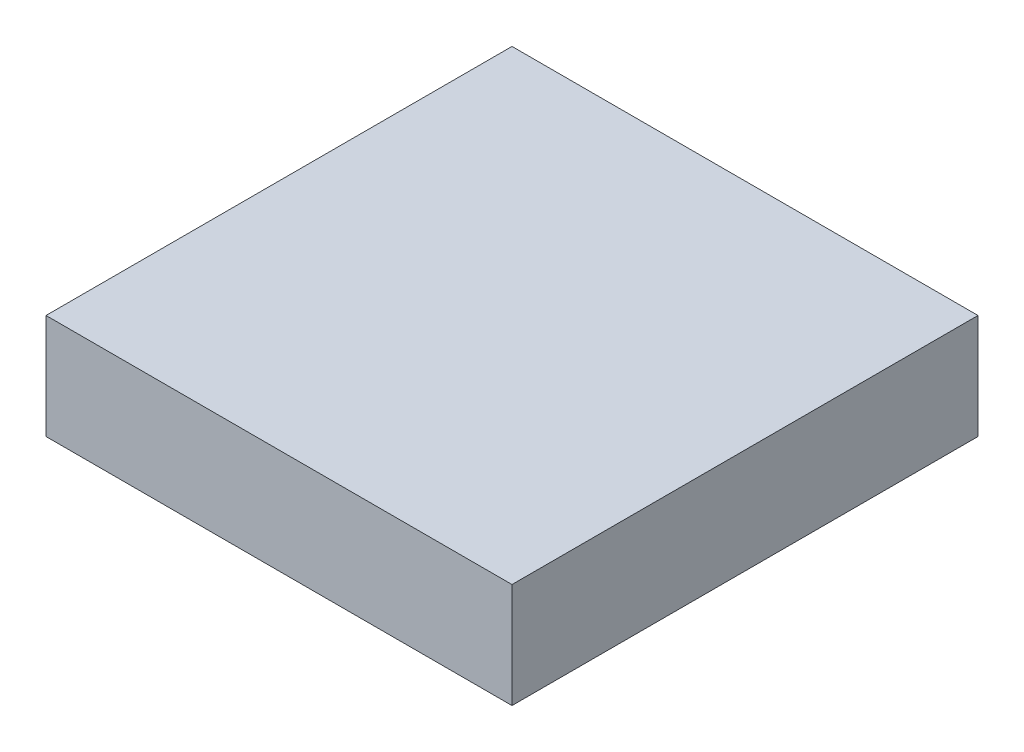
ISO-10303-21;
HEADER;
FILE_DESCRIPTION(('STEP AP214'),'2;1');
FILE_NAME('part.step','',(''),(''),'','','');
FILE_SCHEMA(('AUTOMOTIVE_DESIGN { 1 0 10303 214 1 1 1 1 }'));
ENDSEC;
DATA;
#1=APPLICATION_CONTEXT('core data for automotive mechanical design processes');
#2=APPLICATION_PROTOCOL_DEFINITION('international standard','automotive_design',2000,#1);
#3=PRODUCT_CONTEXT('',#1,'mechanical');
#4=PRODUCT('Part','Part','',(#3));
#5=PRODUCT_RELATED_PRODUCT_CATEGORY('part','',(#4));
#6=PRODUCT_DEFINITION_FORMATION('','',#4);
#7=PRODUCT_DEFINITION_CONTEXT('part definition',#1,'design');
#8=PRODUCT_DEFINITION('design','',#6,#7);
#9=PRODUCT_DEFINITION_SHAPE('','',#8);
#10=(LENGTH_UNIT() NAMED_UNIT(*) SI_UNIT(.MILLI.,.METRE.));
#11=(NAMED_UNIT(*) PLANE_ANGLE_UNIT() SI_UNIT($,.RADIAN.));
#12=(NAMED_UNIT(*) SI_UNIT($,.STERADIAN.) SOLID_ANGLE_UNIT());
#13=UNCERTAINTY_MEASURE_WITH_UNIT(LENGTH_MEASURE(1.E-05),#10,'distance_accuracy_value','');
#14=(GEOMETRIC_REPRESENTATION_CONTEXT(3) GLOBAL_UNCERTAINTY_ASSIGNED_CONTEXT((#13)) GLOBAL_UNIT_ASSIGNED_CONTEXT((#10,
#11,#12)) REPRESENTATION_CONTEXT('',''));
#15=CARTESIAN_POINT('',(0.,0.,0.));
#16=DIRECTION('',(0.,0.,1.));
#17=DIRECTION('',(1.,0.,0.));
#18=AXIS2_PLACEMENT_3D('',#15,#16,#17);
#19=CARTESIAN_POINT('',(-2.,0.9,-2.));
#20=DIRECTION('',(1.,0.,0.));
#21=DIRECTION('',(0.,0.,-1.));
#22=AXIS2_PLACEMENT_3D('',#19,#20,#21);
#23=PLANE('',#22);
#24=DIRECTION('',(0.,0.,1.));
#25=VECTOR('',#24,1.);
#26=CARTESIAN_POINT('',(-2.,0.,-2.));
#27=LINE('',#26,#25);
#28=CARTESIAN_POINT('',(-2.,0.,-2.));
#29=VERTEX_POINT('',#28);
#30=CARTESIAN_POINT('',(-2.,0.,2.));
#31=VERTEX_POINT('',#30);
#32=EDGE_CURVE('E96',#29,#31,#27,.T.);
#33=ORIENTED_EDGE('',*,*,#32,.T.);
#34=DIRECTION('',(0.,-1.,0.));
#35=VECTOR('',#34,1.);
#36=CARTESIAN_POINT('',(-2.,0.9,2.));
#37=LINE('',#36,#35);
#38=CARTESIAN_POINT('',(-2.,0.9,2.));
#39=VERTEX_POINT('',#38);
#40=EDGE_CURVE('E11',#39,#31,#37,.T.);
#41=ORIENTED_EDGE('',*,*,#40,.F.);
#42=DIRECTION('',(0.,0.,1.));
#43=VECTOR('',#42,1.);
#44=CARTESIAN_POINT('',(-2.,0.9,-2.));
#45=LINE('',#44,#43);
#46=CARTESIAN_POINT('',(-2.,0.9,-2.));
#47=VERTEX_POINT('',#46);
#48=EDGE_CURVE('E84',#47,#39,#45,.T.);
#49=ORIENTED_EDGE('',*,*,#48,.F.);
#50=DIRECTION('',(0.,-1.,0.));
#51=VECTOR('',#50,1.);
#52=CARTESIAN_POINT('',(-2.,0.9,-2.));
#53=LINE('',#52,#51);
#54=EDGE_CURVE('E92',#47,#29,#53,.T.);
#55=ORIENTED_EDGE('',*,*,#54,.T.);
#56=EDGE_LOOP('',(#33,#41,#49,#55));
#57=FACE_BOUND('',#56,.T.);
#58=ADVANCED_FACE('F33',(#57),#23,.F.);
#59=CARTESIAN_POINT('',(2.,0.9,2.));
#60=DIRECTION('',(0.,0.,-1.));
#61=DIRECTION('',(-1.,0.,0.));
#62=AXIS2_PLACEMENT_3D('',#59,#60,#61);
#63=PLANE('',#62);
#64=DIRECTION('',(1.,0.,0.));
#65=VECTOR('',#64,1.);
#66=CARTESIAN_POINT('',(2.,0.,2.));
#67=LINE('',#66,#65);
#68=CARTESIAN_POINT('',(2.,0.,2.));
#69=VERTEX_POINT('',#68);
#70=EDGE_CURVE('E88',#31,#69,#67,.T.);
#71=ORIENTED_EDGE('',*,*,#70,.T.);
#72=DIRECTION('',(0.,-1.,0.));
#73=VECTOR('',#72,1.);
#74=CARTESIAN_POINT('',(2.,0.9,2.));
#75=LINE('',#74,#73);
#76=CARTESIAN_POINT('',(2.,0.9,2.));
#77=VERTEX_POINT('',#76);
#78=EDGE_CURVE('E41',#77,#69,#75,.T.);
#79=ORIENTED_EDGE('',*,*,#78,.F.);
#80=DIRECTION('',(1.,0.,0.));
#81=VECTOR('',#80,1.);
#82=CARTESIAN_POINT('',(2.,0.9,2.));
#83=LINE('',#82,#81);
#84=EDGE_CURVE('E79',#39,#77,#83,.T.);
#85=ORIENTED_EDGE('',*,*,#84,.F.);
#86=ORIENTED_EDGE('',*,*,#40,.T.);
#87=EDGE_LOOP('',(#71,#79,#85,#86));
#88=FACE_BOUND('',#87,.T.);
#89=ADVANCED_FACE('F87',(#88),#63,.F.);
#90=CARTESIAN_POINT('',(2.,0.9,-2.));
#91=DIRECTION('',(-1.,0.,0.));
#92=DIRECTION('',(0.,0.,1.));
#93=AXIS2_PLACEMENT_3D('',#90,#91,#92);
#94=PLANE('',#93);
#95=DIRECTION('',(0.,0.,-1.));
#96=VECTOR('',#95,1.);
#97=CARTESIAN_POINT('',(2.,0.,-2.));
#98=LINE('',#97,#96);
#99=CARTESIAN_POINT('',(2.,0.,-2.));
#100=VERTEX_POINT('',#99);
#101=EDGE_CURVE('E66',#69,#100,#98,.T.);
#102=ORIENTED_EDGE('',*,*,#101,.T.);
#103=DIRECTION('',(0.,-1.,0.));
#104=VECTOR('',#103,1.);
#105=CARTESIAN_POINT('',(2.,0.9,-2.));
#106=LINE('',#105,#104);
#107=CARTESIAN_POINT('',(2.,0.9,-2.));
#108=VERTEX_POINT('',#107);
#109=EDGE_CURVE('E89',#108,#100,#106,.T.);
#110=ORIENTED_EDGE('',*,*,#109,.F.);
#111=DIRECTION('',(0.,0.,-1.));
#112=VECTOR('',#111,1.);
#113=CARTESIAN_POINT('',(2.,0.9,-2.));
#114=LINE('',#113,#112);
#115=EDGE_CURVE('E82',#77,#108,#114,.T.);
#116=ORIENTED_EDGE('',*,*,#115,.F.);
#117=ORIENTED_EDGE('',*,*,#78,.T.);
#118=EDGE_LOOP('',(#102,#110,#116,#117));
#119=FACE_BOUND('',#118,.T.);
#120=ADVANCED_FACE('F90',(#119),#94,.F.);
#121=CARTESIAN_POINT('',(2.,0.9,-2.));
#122=DIRECTION('',(0.,0.,1.));
#123=DIRECTION('',(1.,0.,0.));
#124=AXIS2_PLACEMENT_3D('',#121,#122,#123);
#125=PLANE('',#124);
#126=DIRECTION('',(-1.,0.,0.));
#127=VECTOR('',#126,1.);
#128=CARTESIAN_POINT('',(2.,0.,-2.));
#129=LINE('',#128,#127);
#130=EDGE_CURVE('E72',#100,#29,#129,.T.);
#131=ORIENTED_EDGE('',*,*,#130,.T.);
#132=ORIENTED_EDGE('',*,*,#54,.F.);
#133=DIRECTION('',(-1.,0.,0.));
#134=VECTOR('',#133,1.);
#135=CARTESIAN_POINT('',(2.,0.9,-2.));
#136=LINE('',#135,#134);
#137=EDGE_CURVE('E49',#108,#47,#136,.T.);
#138=ORIENTED_EDGE('',*,*,#137,.F.);
#139=ORIENTED_EDGE('',*,*,#109,.T.);
#140=EDGE_LOOP('',(#131,#132,#138,#139));
#141=FACE_BOUND('',#140,.T.);
#142=ADVANCED_FACE('F103',(#141),#125,.F.);
#143=CARTESIAN_POINT('',(0.,0.9,0.));
#144=DIRECTION('',(0.,-1.,0.));
#145=DIRECTION('',(0.,0.,-1.));
#146=AXIS2_PLACEMENT_3D('',#143,#144,#145);
#147=PLANE('',#146);
#148=ORIENTED_EDGE('',*,*,#48,.T.);
#149=ORIENTED_EDGE('',*,*,#84,.T.);
#150=ORIENTED_EDGE('',*,*,#115,.T.);
#151=ORIENTED_EDGE('',*,*,#137,.T.);
#152=EDGE_LOOP('',(#148,#149,#150,#151));
#153=FACE_BOUND('',#152,.T.);
#154=ADVANCED_FACE('F80',(#153),#147,.F.);
#155=CARTESIAN_POINT('',(0.,0.,0.));
#156=DIRECTION('',(0.,-1.,0.));
#157=DIRECTION('',(0.,0.,-1.));
#158=AXIS2_PLACEMENT_3D('',#155,#156,#157);
#159=PLANE('',#158);
#160=ORIENTED_EDGE('',*,*,#32,.F.);
#161=ORIENTED_EDGE('',*,*,#130,.F.);
#162=ORIENTED_EDGE('',*,*,#101,.F.);
#163=ORIENTED_EDGE('',*,*,#70,.F.);
#164=EDGE_LOOP('',(#160,#161,#162,#163));
#165=FACE_BOUND('',#164,.T.);
#166=ADVANCED_FACE('F106',(#165),#159,.T.);
#167=CLOSED_SHELL('',(#58,#89,#120,#142,#154,#166));
#168=MANIFOLD_SOLID_BREP('B2',#167);
#169=ADVANCED_BREP_SHAPE_REPRESENTATION('',(#18,#168),#14);
#170=SHAPE_DEFINITION_REPRESENTATION(#9,#169);
ENDSEC;
END-ISO-10303-21;
